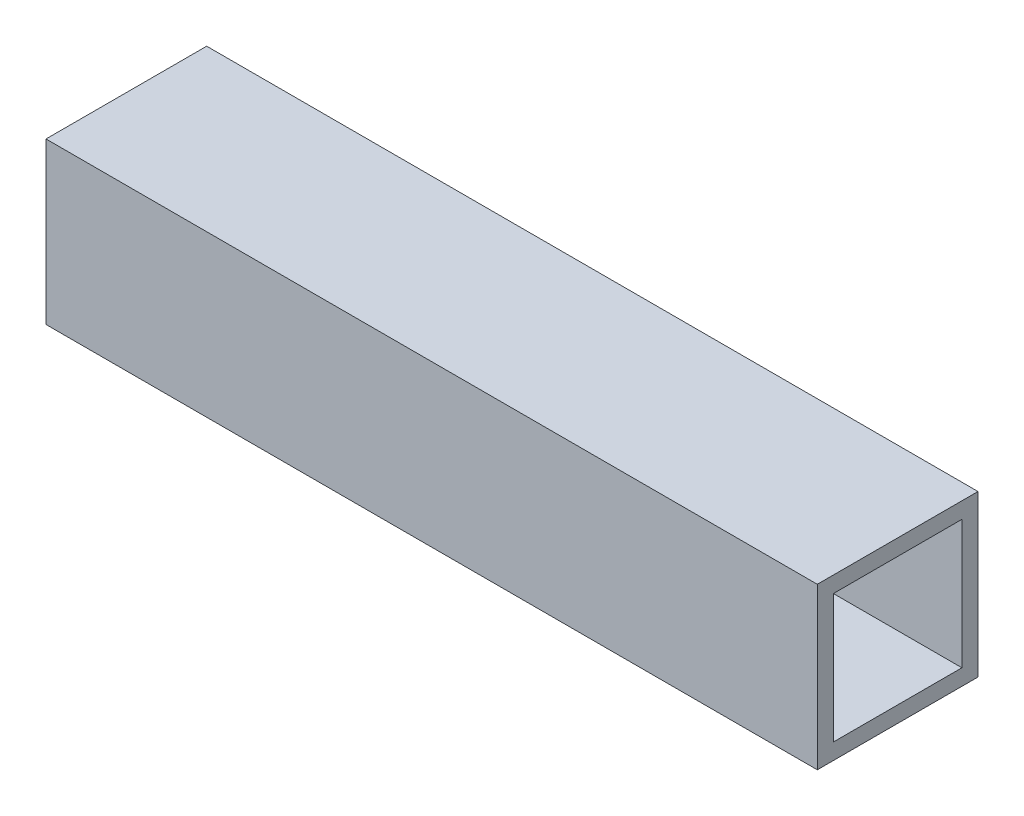
ISO-10303-21;
HEADER;
FILE_DESCRIPTION(('STEP AP214'),'2;1');
FILE_NAME('part.step','',(''),(''),'','','');
FILE_SCHEMA(('AUTOMOTIVE_DESIGN { 1 0 10303 214 1 1 1 1 }'));
ENDSEC;
DATA;
#1=APPLICATION_CONTEXT('core data for automotive mechanical design processes');
#2=APPLICATION_PROTOCOL_DEFINITION('international standard','automotive_design',2000,#1);
#3=PRODUCT_CONTEXT('',#1,'mechanical');
#4=PRODUCT('Part','Part','',(#3));
#5=PRODUCT_RELATED_PRODUCT_CATEGORY('part','',(#4));
#6=PRODUCT_DEFINITION_FORMATION('','',#4);
#7=PRODUCT_DEFINITION_CONTEXT('part definition',#1,'design');
#8=PRODUCT_DEFINITION('design','',#6,#7);
#9=PRODUCT_DEFINITION_SHAPE('','',#8);
#10=(LENGTH_UNIT() NAMED_UNIT(*) SI_UNIT(.MILLI.,.METRE.));
#11=(NAMED_UNIT(*) PLANE_ANGLE_UNIT() SI_UNIT($,.RADIAN.));
#12=(NAMED_UNIT(*) SI_UNIT($,.STERADIAN.) SOLID_ANGLE_UNIT());
#13=UNCERTAINTY_MEASURE_WITH_UNIT(LENGTH_MEASURE(1.E-05),#10,'distance_accuracy_value','');
#14=(GEOMETRIC_REPRESENTATION_CONTEXT(3) GLOBAL_UNCERTAINTY_ASSIGNED_CONTEXT((#13)) GLOBAL_UNIT_ASSIGNED_CONTEXT((#10,
#11,#12)) REPRESENTATION_CONTEXT('',''));
#15=CARTESIAN_POINT('',(0.,0.,0.));
#16=DIRECTION('',(0.,0.,1.));
#17=DIRECTION('',(1.,0.,0.));
#18=AXIS2_PLACEMENT_3D('',#15,#16,#17);
#19=CARTESIAN_POINT('',(76.2,0.,0.));
#20=DIRECTION('',(-1.,0.,0.));
#21=DIRECTION('',(0.,0.,1.));
#22=AXIS2_PLACEMENT_3D('',#19,#20,#21);
#23=PLANE('',#22);
#24=DIRECTION('',(0.,1.,0.));
#25=VECTOR('',#24,1.);
#26=CARTESIAN_POINT('',(76.2,-15.875,-15.875));
#27=LINE('',#26,#25);
#28=CARTESIAN_POINT('',(76.2,-15.875,-15.875));
#29=VERTEX_POINT('',#28);
#30=CARTESIAN_POINT('',(76.2,15.875,-15.875));
#31=VERTEX_POINT('',#30);
#32=EDGE_CURVE('E134',#29,#31,#27,.T.);
#33=ORIENTED_EDGE('',*,*,#32,.T.);
#34=DIRECTION('',(0.,0.,1.));
#35=VECTOR('',#34,1.);
#36=CARTESIAN_POINT('',(76.2,15.875,15.875));
#37=LINE('',#36,#35);
#38=CARTESIAN_POINT('',(76.2,15.875,15.875));
#39=VERTEX_POINT('',#38);
#40=EDGE_CURVE('E137',#31,#39,#37,.T.);
#41=ORIENTED_EDGE('',*,*,#40,.T.);
#42=DIRECTION('',(0.,-1.,0.));
#43=VECTOR('',#42,1.);
#44=CARTESIAN_POINT('',(76.2,-15.875,15.875));
#45=LINE('',#44,#43);
#46=CARTESIAN_POINT('',(76.2,-15.875,15.875));
#47=VERTEX_POINT('',#46);
#48=EDGE_CURVE('E140',#39,#47,#45,.T.);
#49=ORIENTED_EDGE('',*,*,#48,.T.);
#50=DIRECTION('',(0.,0.,-1.));
#51=VECTOR('',#50,1.);
#52=CARTESIAN_POINT('',(76.2,-15.875,15.875));
#53=LINE('',#52,#51);
#54=EDGE_CURVE('E142',#47,#29,#53,.T.);
#55=ORIENTED_EDGE('',*,*,#54,.T.);
#56=EDGE_LOOP('',(#33,#41,#49,#55));
#57=FACE_BOUND('',#56,.T.);
#58=DIRECTION('',(0.,1.,0.));
#59=VECTOR('',#58,1.);
#60=CARTESIAN_POINT('',(76.2,-12.7,-12.7));
#61=LINE('',#60,#59);
#62=CARTESIAN_POINT('',(76.2,-12.7,-12.7));
#63=VERTEX_POINT('',#62);
#64=CARTESIAN_POINT('',(76.2,12.7,-12.7));
#65=VERTEX_POINT('',#64);
#66=EDGE_CURVE('E98',#63,#65,#61,.T.);
#67=ORIENTED_EDGE('',*,*,#66,.F.);
#68=DIRECTION('',(0.,0.,-1.));
#69=VECTOR('',#68,1.);
#70=CARTESIAN_POINT('',(76.2,-12.7,12.7));
#71=LINE('',#70,#69);
#72=CARTESIAN_POINT('',(76.2,-12.7,12.7));
#73=VERTEX_POINT('',#72);
#74=EDGE_CURVE('E120',#73,#63,#71,.T.);
#75=ORIENTED_EDGE('',*,*,#74,.F.);
#76=DIRECTION('',(0.,-1.,0.));
#77=VECTOR('',#76,1.);
#78=CARTESIAN_POINT('',(76.2,-12.7,12.7));
#79=LINE('',#78,#77);
#80=CARTESIAN_POINT('',(76.2,12.7,12.7));
#81=VERTEX_POINT('',#80);
#82=EDGE_CURVE('E118',#81,#73,#79,.T.);
#83=ORIENTED_EDGE('',*,*,#82,.F.);
#84=DIRECTION('',(0.,0.,1.));
#85=VECTOR('',#84,1.);
#86=CARTESIAN_POINT('',(76.2,12.7,12.7));
#87=LINE('',#86,#85);
#88=EDGE_CURVE('E106',#65,#81,#87,.T.);
#89=ORIENTED_EDGE('',*,*,#88,.F.);
#90=EDGE_LOOP('',(#67,#75,#83,#89));
#91=FACE_BOUND('',#90,.T.);
#92=ADVANCED_FACE('F33',(#57,#91),#23,.F.);
#93=CARTESIAN_POINT('',(-76.2,0.,0.));
#94=DIRECTION('',(-1.,0.,0.));
#95=DIRECTION('',(0.,0.,1.));
#96=AXIS2_PLACEMENT_3D('',#93,#94,#95);
#97=PLANE('',#96);
#98=DIRECTION('',(0.,1.,0.));
#99=VECTOR('',#98,1.);
#100=CARTESIAN_POINT('',(-76.2,-15.875,-15.875));
#101=LINE('',#100,#99);
#102=CARTESIAN_POINT('',(-76.2,-15.875,-15.875));
#103=VERTEX_POINT('',#102);
#104=CARTESIAN_POINT('',(-76.2,15.875,-15.875));
#105=VERTEX_POINT('',#104);
#106=EDGE_CURVE('E114',#103,#105,#101,.T.);
#107=ORIENTED_EDGE('',*,*,#106,.F.);
#108=DIRECTION('',(0.,0.,-1.));
#109=VECTOR('',#108,1.);
#110=CARTESIAN_POINT('',(-76.2,-15.875,15.875));
#111=LINE('',#110,#109);
#112=CARTESIAN_POINT('',(-76.2,-15.875,15.875));
#113=VERTEX_POINT('',#112);
#114=EDGE_CURVE('E138',#113,#103,#111,.T.);
#115=ORIENTED_EDGE('',*,*,#114,.F.);
#116=DIRECTION('',(0.,-1.,0.));
#117=VECTOR('',#116,1.);
#118=CARTESIAN_POINT('',(-76.2,-15.875,15.875));
#119=LINE('',#118,#117);
#120=CARTESIAN_POINT('',(-76.2,15.875,15.875));
#121=VERTEX_POINT('',#120);
#122=EDGE_CURVE('E149',#121,#113,#119,.T.);
#123=ORIENTED_EDGE('',*,*,#122,.F.);
#124=DIRECTION('',(0.,0.,1.));
#125=VECTOR('',#124,1.);
#126=CARTESIAN_POINT('',(-76.2,15.875,15.875));
#127=LINE('',#126,#125);
#128=EDGE_CURVE('E147',#105,#121,#127,.T.);
#129=ORIENTED_EDGE('',*,*,#128,.F.);
#130=EDGE_LOOP('',(#107,#115,#123,#129));
#131=FACE_BOUND('',#130,.T.);
#132=DIRECTION('',(0.,0.,-1.));
#133=VECTOR('',#132,1.);
#134=CARTESIAN_POINT('',(-76.2,-12.7,12.7));
#135=LINE('',#134,#133);
#136=CARTESIAN_POINT('',(-76.2,-12.7,12.7));
#137=VERTEX_POINT('',#136);
#138=CARTESIAN_POINT('',(-76.2,-12.7,-12.7));
#139=VERTEX_POINT('',#138);
#140=EDGE_CURVE('E107',#137,#139,#135,.T.);
#141=ORIENTED_EDGE('',*,*,#140,.T.);
#142=DIRECTION('',(0.,1.,0.));
#143=VECTOR('',#142,1.);
#144=CARTESIAN_POINT('',(-76.2,-12.7,-12.7));
#145=LINE('',#144,#143);
#146=CARTESIAN_POINT('',(-76.2,12.7,-12.7));
#147=VERTEX_POINT('',#146);
#148=EDGE_CURVE('E56',#139,#147,#145,.T.);
#149=ORIENTED_EDGE('',*,*,#148,.T.);
#150=DIRECTION('',(0.,0.,1.));
#151=VECTOR('',#150,1.);
#152=CARTESIAN_POINT('',(-76.2,12.7,12.7));
#153=LINE('',#152,#151);
#154=CARTESIAN_POINT('',(-76.2,12.7,12.7));
#155=VERTEX_POINT('',#154);
#156=EDGE_CURVE('E113',#147,#155,#153,.T.);
#157=ORIENTED_EDGE('',*,*,#156,.T.);
#158=DIRECTION('',(0.,-1.,0.));
#159=VECTOR('',#158,1.);
#160=CARTESIAN_POINT('',(-76.2,-12.7,12.7));
#161=LINE('',#160,#159);
#162=EDGE_CURVE('E126',#155,#137,#161,.T.);
#163=ORIENTED_EDGE('',*,*,#162,.T.);
#164=EDGE_LOOP('',(#141,#149,#157,#163));
#165=FACE_BOUND('',#164,.T.);
#166=ADVANCED_FACE('F167',(#131,#165),#97,.T.);
#167=CARTESIAN_POINT('',(76.2,-15.875,-15.875));
#168=DIRECTION('',(0.,0.,1.));
#169=DIRECTION('',(1.,0.,0.));
#170=AXIS2_PLACEMENT_3D('',#167,#168,#169);
#171=PLANE('',#170);
#172=ORIENTED_EDGE('',*,*,#106,.T.);
#173=DIRECTION('',(-1.,0.,0.));
#174=VECTOR('',#173,1.);
#175=CARTESIAN_POINT('',(76.2,15.875,-15.875));
#176=LINE('',#175,#174);
#177=EDGE_CURVE('E11',#31,#105,#176,.T.);
#178=ORIENTED_EDGE('',*,*,#177,.F.);
#179=ORIENTED_EDGE('',*,*,#32,.F.);
#180=DIRECTION('',(-1.,0.,0.));
#181=VECTOR('',#180,1.);
#182=CARTESIAN_POINT('',(76.2,-15.875,-15.875));
#183=LINE('',#182,#181);
#184=EDGE_CURVE('E144',#29,#103,#183,.T.);
#185=ORIENTED_EDGE('',*,*,#184,.T.);
#186=EDGE_LOOP('',(#172,#178,#179,#185));
#187=FACE_BOUND('',#186,.T.);
#188=ADVANCED_FACE('F35',(#187),#171,.F.);
#189=CARTESIAN_POINT('',(76.2,15.875,15.875));
#190=DIRECTION('',(0.,-1.,0.));
#191=DIRECTION('',(0.,0.,-1.));
#192=AXIS2_PLACEMENT_3D('',#189,#190,#191);
#193=PLANE('',#192);
#194=ORIENTED_EDGE('',*,*,#128,.T.);
#195=DIRECTION('',(-1.,0.,0.));
#196=VECTOR('',#195,1.);
#197=CARTESIAN_POINT('',(76.2,15.875,15.875));
#198=LINE('',#197,#196);
#199=EDGE_CURVE('E41',#39,#121,#198,.T.);
#200=ORIENTED_EDGE('',*,*,#199,.F.);
#201=ORIENTED_EDGE('',*,*,#40,.F.);
#202=ORIENTED_EDGE('',*,*,#177,.T.);
#203=EDGE_LOOP('',(#194,#200,#201,#202));
#204=FACE_BOUND('',#203,.T.);
#205=ADVANCED_FACE('F177',(#204),#193,.F.);
#206=CARTESIAN_POINT('',(76.2,-15.875,15.875));
#207=DIRECTION('',(0.,0.,-1.));
#208=DIRECTION('',(-1.,0.,0.));
#209=AXIS2_PLACEMENT_3D('',#206,#207,#208);
#210=PLANE('',#209);
#211=ORIENTED_EDGE('',*,*,#122,.T.);
#212=DIRECTION('',(-1.,0.,0.));
#213=VECTOR('',#212,1.);
#214=CARTESIAN_POINT('',(76.2,-15.875,15.875));
#215=LINE('',#214,#213);
#216=EDGE_CURVE('E154',#47,#113,#215,.T.);
#217=ORIENTED_EDGE('',*,*,#216,.F.);
#218=ORIENTED_EDGE('',*,*,#48,.F.);
#219=ORIENTED_EDGE('',*,*,#199,.T.);
#220=EDGE_LOOP('',(#211,#217,#218,#219));
#221=FACE_BOUND('',#220,.T.);
#222=ADVANCED_FACE('F161',(#221),#210,.F.);
#223=CARTESIAN_POINT('',(76.2,-15.875,15.875));
#224=DIRECTION('',(0.,1.,0.));
#225=DIRECTION('',(0.,0.,1.));
#226=AXIS2_PLACEMENT_3D('',#223,#224,#225);
#227=PLANE('',#226);
#228=ORIENTED_EDGE('',*,*,#114,.T.);
#229=ORIENTED_EDGE('',*,*,#184,.F.);
#230=ORIENTED_EDGE('',*,*,#54,.F.);
#231=ORIENTED_EDGE('',*,*,#216,.T.);
#232=EDGE_LOOP('',(#228,#229,#230,#231));
#233=FACE_BOUND('',#232,.T.);
#234=ADVANCED_FACE('F171',(#233),#227,.F.);
#235=CARTESIAN_POINT('',(76.2,-12.7,-12.7));
#236=DIRECTION('',(0.,0.,1.));
#237=DIRECTION('',(1.,0.,0.));
#238=AXIS2_PLACEMENT_3D('',#235,#236,#237);
#239=PLANE('',#238);
#240=ORIENTED_EDGE('',*,*,#148,.F.);
#241=DIRECTION('',(-1.,0.,0.));
#242=VECTOR('',#241,1.);
#243=CARTESIAN_POINT('',(76.2,-12.7,-12.7));
#244=LINE('',#243,#242);
#245=EDGE_CURVE('E102',#63,#139,#244,.T.);
#246=ORIENTED_EDGE('',*,*,#245,.F.);
#247=ORIENTED_EDGE('',*,*,#66,.T.);
#248=DIRECTION('',(-1.,0.,0.));
#249=VECTOR('',#248,1.);
#250=CARTESIAN_POINT('',(76.2,12.7,-12.7));
#251=LINE('',#250,#249);
#252=EDGE_CURVE('E101',#65,#147,#251,.T.);
#253=ORIENTED_EDGE('',*,*,#252,.T.);
#254=EDGE_LOOP('',(#240,#246,#247,#253));
#255=FACE_BOUND('',#254,.T.);
#256=ADVANCED_FACE('F100',(#255),#239,.T.);
#257=CARTESIAN_POINT('',(76.2,12.7,12.7));
#258=DIRECTION('',(0.,-1.,0.));
#259=DIRECTION('',(0.,0.,-1.));
#260=AXIS2_PLACEMENT_3D('',#257,#258,#259);
#261=PLANE('',#260);
#262=ORIENTED_EDGE('',*,*,#156,.F.);
#263=ORIENTED_EDGE('',*,*,#252,.F.);
#264=ORIENTED_EDGE('',*,*,#88,.T.);
#265=DIRECTION('',(-1.,0.,0.));
#266=VECTOR('',#265,1.);
#267=CARTESIAN_POINT('',(76.2,12.7,12.7));
#268=LINE('',#267,#266);
#269=EDGE_CURVE('E115',#81,#155,#268,.T.);
#270=ORIENTED_EDGE('',*,*,#269,.T.);
#271=EDGE_LOOP('',(#262,#263,#264,#270));
#272=FACE_BOUND('',#271,.T.);
#273=ADVANCED_FACE('F110',(#272),#261,.T.);
#274=CARTESIAN_POINT('',(76.2,-12.7,12.7));
#275=DIRECTION('',(0.,0.,-1.));
#276=DIRECTION('',(-1.,0.,0.));
#277=AXIS2_PLACEMENT_3D('',#274,#275,#276);
#278=PLANE('',#277);
#279=ORIENTED_EDGE('',*,*,#162,.F.);
#280=ORIENTED_EDGE('',*,*,#269,.F.);
#281=ORIENTED_EDGE('',*,*,#82,.T.);
#282=DIRECTION('',(-1.,0.,0.));
#283=VECTOR('',#282,1.);
#284=CARTESIAN_POINT('',(76.2,-12.7,12.7));
#285=LINE('',#284,#283);
#286=EDGE_CURVE('E48',#73,#137,#285,.T.);
#287=ORIENTED_EDGE('',*,*,#286,.T.);
#288=EDGE_LOOP('',(#279,#280,#281,#287));
#289=FACE_BOUND('',#288,.T.);
#290=ADVANCED_FACE('F200',(#289),#278,.T.);
#291=CARTESIAN_POINT('',(76.2,-12.7,12.7));
#292=DIRECTION('',(0.,1.,0.));
#293=DIRECTION('',(0.,0.,1.));
#294=AXIS2_PLACEMENT_3D('',#291,#292,#293);
#295=PLANE('',#294);
#296=ORIENTED_EDGE('',*,*,#140,.F.);
#297=ORIENTED_EDGE('',*,*,#286,.F.);
#298=ORIENTED_EDGE('',*,*,#74,.T.);
#299=ORIENTED_EDGE('',*,*,#245,.T.);
#300=EDGE_LOOP('',(#296,#297,#298,#299));
#301=FACE_BOUND('',#300,.T.);
#302=ADVANCED_FACE('F204',(#301),#295,.T.);
#303=CLOSED_SHELL('',(#92,#166,#188,#205,#222,#234,#256,#273,#290,#302));
#304=MANIFOLD_SOLID_BREP('B2',#303);
#305=ADVANCED_BREP_SHAPE_REPRESENTATION('',(#18,#304),#14);
#306=SHAPE_DEFINITION_REPRESENTATION(#9,#305);
ENDSEC;
END-ISO-10303-21;
